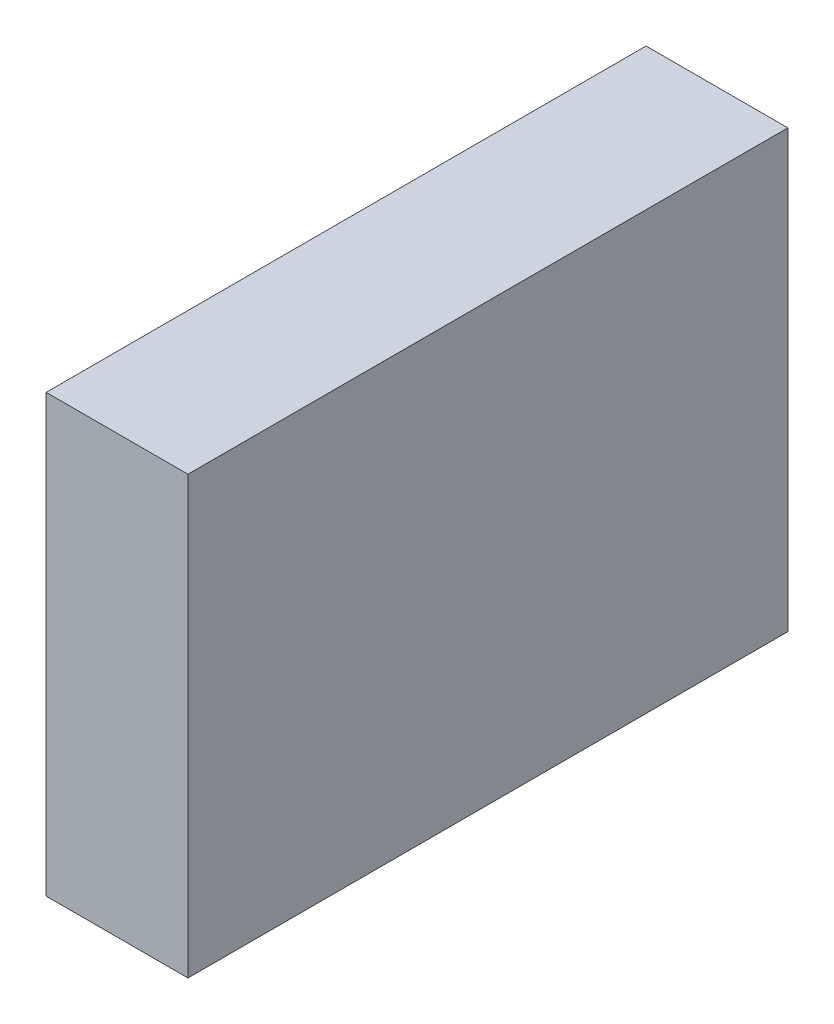
ISO-10303-21;
HEADER;
FILE_DESCRIPTION(('STEP AP214'),'2;1');
FILE_NAME('part.step','',(''),(''),'','','');
FILE_SCHEMA(('AUTOMOTIVE_DESIGN { 1 0 10303 214 1 1 1 1 }'));
ENDSEC;
DATA;
#1=APPLICATION_CONTEXT('core data for automotive mechanical design processes');
#2=APPLICATION_PROTOCOL_DEFINITION('international standard','automotive_design',2000,#1);
#3=PRODUCT_CONTEXT('',#1,'mechanical');
#4=PRODUCT('Part','Part','',(#3));
#5=PRODUCT_RELATED_PRODUCT_CATEGORY('part','',(#4));
#6=PRODUCT_DEFINITION_FORMATION('','',#4);
#7=PRODUCT_DEFINITION_CONTEXT('part definition',#1,'design');
#8=PRODUCT_DEFINITION('design','',#6,#7);
#9=PRODUCT_DEFINITION_SHAPE('','',#8);
#10=(LENGTH_UNIT() NAMED_UNIT(*) SI_UNIT(.MILLI.,.METRE.));
#11=(NAMED_UNIT(*) PLANE_ANGLE_UNIT() SI_UNIT($,.RADIAN.));
#12=(NAMED_UNIT(*) SI_UNIT($,.STERADIAN.) SOLID_ANGLE_UNIT());
#13=UNCERTAINTY_MEASURE_WITH_UNIT(LENGTH_MEASURE(1.E-05),#10,'distance_accuracy_value','');
#14=(GEOMETRIC_REPRESENTATION_CONTEXT(3) GLOBAL_UNCERTAINTY_ASSIGNED_CONTEXT((#13)) GLOBAL_UNIT_ASSIGNED_CONTEXT((#10,
#11,#12)) REPRESENTATION_CONTEXT('',''));
#15=CARTESIAN_POINT('',(0.,0.,0.));
#16=DIRECTION('',(0.,0.,1.));
#17=DIRECTION('',(1.,0.,0.));
#18=AXIS2_PLACEMENT_3D('',#15,#16,#17);
#19=CARTESIAN_POINT('',(368.466548048329,278.,55.));
#20=DIRECTION('',(1.,0.,0.));
#21=DIRECTION('',(0.,0.,-1.));
#22=AXIS2_PLACEMENT_3D('',#19,#20,#21);
#23=PLANE('',#22);
#24=DIRECTION('',(0.,-1.,0.));
#25=VECTOR('',#24,1.);
#26=CARTESIAN_POINT('',(368.466548048329,278.,0.));
#27=LINE('',#26,#25);
#28=CARTESIAN_POINT('',(368.466548048329,278.,0.));
#29=VERTEX_POINT('',#28);
#30=CARTESIAN_POINT('',(368.466548048329,238.,0.));
#31=VERTEX_POINT('',#30);
#32=EDGE_CURVE('E98',#29,#31,#27,.T.);
#33=ORIENTED_EDGE('',*,*,#32,.T.);
#34=DIRECTION('',(0.,0.,-1.));
#35=VECTOR('',#34,1.);
#36=CARTESIAN_POINT('',(368.466548048329,238.,55.));
#37=LINE('',#36,#35);
#38=CARTESIAN_POINT('',(368.466548048329,238.,55.));
#39=VERTEX_POINT('',#38);
#40=EDGE_CURVE('E11',#39,#31,#37,.T.);
#41=ORIENTED_EDGE('',*,*,#40,.F.);
#42=DIRECTION('',(0.,-1.,0.));
#43=VECTOR('',#42,1.);
#44=CARTESIAN_POINT('',(368.466548048329,278.,55.));
#45=LINE('',#44,#43);
#46=CARTESIAN_POINT('',(368.466548048329,278.,55.));
#47=VERTEX_POINT('',#46);
#48=EDGE_CURVE('E86',#47,#39,#45,.T.);
#49=ORIENTED_EDGE('',*,*,#48,.F.);
#50=DIRECTION('',(0.,0.,-1.));
#51=VECTOR('',#50,1.);
#52=CARTESIAN_POINT('',(368.466548048329,278.,55.));
#53=LINE('',#52,#51);
#54=EDGE_CURVE('E94',#47,#29,#53,.T.);
#55=ORIENTED_EDGE('',*,*,#54,.T.);
#56=EDGE_LOOP('',(#33,#41,#49,#55));
#57=FACE_BOUND('',#56,.T.);
#58=ADVANCED_FACE('F35',(#57),#23,.F.);
#59=CARTESIAN_POINT('',(368.466548048329,238.,55.));
#60=DIRECTION('',(0.,1.,0.));
#61=DIRECTION('',(0.,0.,1.));
#62=AXIS2_PLACEMENT_3D('',#59,#60,#61);
#63=PLANE('',#62);
#64=DIRECTION('',(1.,0.,0.));
#65=VECTOR('',#64,1.);
#66=CARTESIAN_POINT('',(368.466548048329,238.,0.));
#67=LINE('',#66,#65);
#68=CARTESIAN_POINT('',(381.466548048329,238.,0.));
#69=VERTEX_POINT('',#68);
#70=EDGE_CURVE('E90',#31,#69,#67,.T.);
#71=ORIENTED_EDGE('',*,*,#70,.T.);
#72=DIRECTION('',(0.,0.,-1.));
#73=VECTOR('',#72,1.);
#74=CARTESIAN_POINT('',(381.466548048329,238.,55.));
#75=LINE('',#74,#73);
#76=CARTESIAN_POINT('',(381.466548048329,238.,55.));
#77=VERTEX_POINT('',#76);
#78=EDGE_CURVE('E43',#77,#69,#75,.T.);
#79=ORIENTED_EDGE('',*,*,#78,.F.);
#80=DIRECTION('',(1.,0.,0.));
#81=VECTOR('',#80,1.);
#82=CARTESIAN_POINT('',(368.466548048329,238.,55.));
#83=LINE('',#82,#81);
#84=EDGE_CURVE('E81',#39,#77,#83,.T.);
#85=ORIENTED_EDGE('',*,*,#84,.F.);
#86=ORIENTED_EDGE('',*,*,#40,.T.);
#87=EDGE_LOOP('',(#71,#79,#85,#86));
#88=FACE_BOUND('',#87,.T.);
#89=ADVANCED_FACE('F89',(#88),#63,.F.);
#90=CARTESIAN_POINT('',(381.466548048329,278.,55.));
#91=DIRECTION('',(-1.,0.,0.));
#92=DIRECTION('',(0.,0.,1.));
#93=AXIS2_PLACEMENT_3D('',#90,#91,#92);
#94=PLANE('',#93);
#95=DIRECTION('',(0.,1.,0.));
#96=VECTOR('',#95,1.);
#97=CARTESIAN_POINT('',(381.466548048329,278.,0.));
#98=LINE('',#97,#96);
#99=CARTESIAN_POINT('',(381.466548048329,278.,0.));
#100=VERTEX_POINT('',#99);
#101=EDGE_CURVE('E68',#69,#100,#98,.T.);
#102=ORIENTED_EDGE('',*,*,#101,.T.);
#103=DIRECTION('',(0.,0.,-1.));
#104=VECTOR('',#103,1.);
#105=CARTESIAN_POINT('',(381.466548048329,278.,55.));
#106=LINE('',#105,#104);
#107=CARTESIAN_POINT('',(381.466548048329,278.,55.));
#108=VERTEX_POINT('',#107);
#109=EDGE_CURVE('E91',#108,#100,#106,.T.);
#110=ORIENTED_EDGE('',*,*,#109,.F.);
#111=DIRECTION('',(0.,1.,0.));
#112=VECTOR('',#111,1.);
#113=CARTESIAN_POINT('',(381.466548048329,278.,55.));
#114=LINE('',#113,#112);
#115=EDGE_CURVE('E84',#77,#108,#114,.T.);
#116=ORIENTED_EDGE('',*,*,#115,.F.);
#117=ORIENTED_EDGE('',*,*,#78,.T.);
#118=EDGE_LOOP('',(#102,#110,#116,#117));
#119=FACE_BOUND('',#118,.T.);
#120=ADVANCED_FACE('F92',(#119),#94,.F.);
#121=CARTESIAN_POINT('',(368.466548048329,278.,55.));
#122=DIRECTION('',(0.,-1.,0.));
#123=DIRECTION('',(0.,0.,-1.));
#124=AXIS2_PLACEMENT_3D('',#121,#122,#123);
#125=PLANE('',#124);
#126=DIRECTION('',(-1.,0.,0.));
#127=VECTOR('',#126,1.);
#128=CARTESIAN_POINT('',(368.466548048329,278.,0.));
#129=LINE('',#128,#127);
#130=EDGE_CURVE('E74',#100,#29,#129,.T.);
#131=ORIENTED_EDGE('',*,*,#130,.T.);
#132=ORIENTED_EDGE('',*,*,#54,.F.);
#133=DIRECTION('',(-1.,0.,0.));
#134=VECTOR('',#133,1.);
#135=CARTESIAN_POINT('',(368.466548048329,278.,55.));
#136=LINE('',#135,#134);
#137=EDGE_CURVE('E51',#108,#47,#136,.T.);
#138=ORIENTED_EDGE('',*,*,#137,.F.);
#139=ORIENTED_EDGE('',*,*,#109,.T.);
#140=EDGE_LOOP('',(#131,#132,#138,#139));
#141=FACE_BOUND('',#140,.T.);
#142=ADVANCED_FACE('F105',(#141),#125,.F.);
#143=CARTESIAN_POINT('',(0.,0.,55.));
#144=DIRECTION('',(0.,0.,1.));
#145=DIRECTION('',(1.,0.,0.));
#146=AXIS2_PLACEMENT_3D('',#143,#144,#145);
#147=PLANE('',#146);
#148=ORIENTED_EDGE('',*,*,#48,.T.);
#149=ORIENTED_EDGE('',*,*,#84,.T.);
#150=ORIENTED_EDGE('',*,*,#115,.T.);
#151=ORIENTED_EDGE('',*,*,#137,.T.);
#152=EDGE_LOOP('',(#148,#149,#150,#151));
#153=FACE_BOUND('',#152,.T.);
#154=ADVANCED_FACE('F82',(#153),#147,.T.);
#155=CARTESIAN_POINT('',(0.,0.,0.));
#156=DIRECTION('',(0.,0.,1.));
#157=DIRECTION('',(1.,0.,0.));
#158=AXIS2_PLACEMENT_3D('',#155,#156,#157);
#159=PLANE('',#158);
#160=ORIENTED_EDGE('',*,*,#32,.F.);
#161=ORIENTED_EDGE('',*,*,#130,.F.);
#162=ORIENTED_EDGE('',*,*,#101,.F.);
#163=ORIENTED_EDGE('',*,*,#70,.F.);
#164=EDGE_LOOP('',(#160,#161,#162,#163));
#165=FACE_BOUND('',#164,.T.);
#166=ADVANCED_FACE('F108',(#165),#159,.F.);
#167=CLOSED_SHELL('',(#58,#89,#120,#142,#154,#166));
#168=MANIFOLD_SOLID_BREP('B2',#167);
#169=ADVANCED_BREP_SHAPE_REPRESENTATION('',(#18,#168),#14);
#170=SHAPE_DEFINITION_REPRESENTATION(#9,#169);
ENDSEC;
END-ISO-10303-21;
